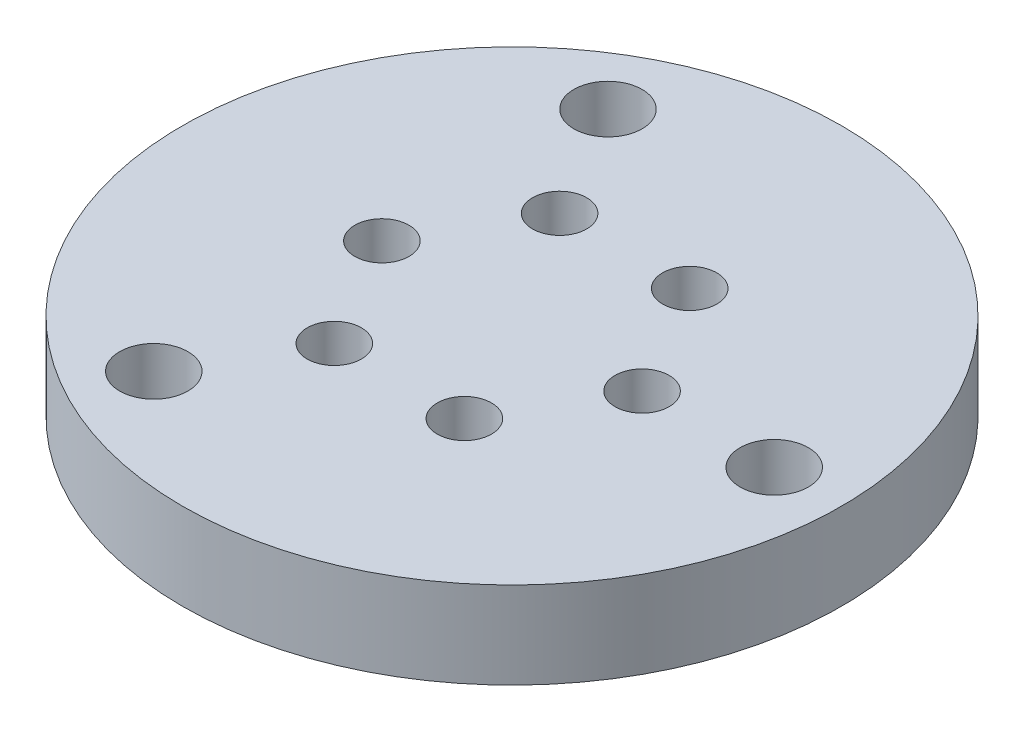
ISO-10303-21;
HEADER;
FILE_DESCRIPTION(('STEP AP214'),'2;1');
FILE_NAME('part.step','',(''),(''),'','','');
FILE_SCHEMA(('AUTOMOTIVE_DESIGN { 1 0 10303 214 1 1 1 1 }'));
ENDSEC;
DATA;
#1=APPLICATION_CONTEXT('core data for automotive mechanical design processes');
#2=APPLICATION_PROTOCOL_DEFINITION('international standard','automotive_design',2000,#1);
#3=PRODUCT_CONTEXT('',#1,'mechanical');
#4=PRODUCT('Part','Part','',(#3));
#5=PRODUCT_RELATED_PRODUCT_CATEGORY('part','',(#4));
#6=PRODUCT_DEFINITION_FORMATION('','',#4);
#7=PRODUCT_DEFINITION_CONTEXT('part definition',#1,'design');
#8=PRODUCT_DEFINITION('design','',#6,#7);
#9=PRODUCT_DEFINITION_SHAPE('','',#8);
#10=(LENGTH_UNIT() NAMED_UNIT(*) SI_UNIT(.MILLI.,.METRE.));
#11=(NAMED_UNIT(*) PLANE_ANGLE_UNIT() SI_UNIT($,.RADIAN.));
#12=(NAMED_UNIT(*) SI_UNIT($,.STERADIAN.) SOLID_ANGLE_UNIT());
#13=UNCERTAINTY_MEASURE_WITH_UNIT(LENGTH_MEASURE(1.E-05),#10,'distance_accuracy_value','');
#14=(GEOMETRIC_REPRESENTATION_CONTEXT(3) GLOBAL_UNCERTAINTY_ASSIGNED_CONTEXT((#13)) GLOBAL_UNIT_ASSIGNED_CONTEXT((#10,
#11,#12)) REPRESENTATION_CONTEXT('',''));
#15=CARTESIAN_POINT('',(0.,0.,0.));
#16=DIRECTION('',(0.,0.,1.));
#17=DIRECTION('',(1.,0.,0.));
#18=AXIS2_PLACEMENT_3D('',#15,#16,#17);
#19=CARTESIAN_POINT('',(0.,6.35,0.));
#20=DIRECTION('',(0.,1.,0.));
#21=DIRECTION('',(0.,0.,1.));
#22=AXIS2_PLACEMENT_3D('',#19,#20,#21);
#23=PLANE('',#22);
#24=CARTESIAN_POINT('',(4.76249999999999,6.35,-8.24889197104679));
#25=DIRECTION('',(0.,1.,0.));
#26=DIRECTION('',(0.,0.,1.));
#27=AXIS2_PLACEMENT_3D('',#24,#25,#26);
#28=CIRCLE('',#27,1.98437499999999);
#29=CARTESIAN_POINT('',(4.76249999999999,6.35,-6.2645169710468));
#30=VERTEX_POINT('',#29);
#31=EDGE_CURVE('E94',#30,#30,#28,.T.);
#32=ORIENTED_EDGE('',*,*,#31,.F.);
#33=EDGE_LOOP('',(#32));
#34=FACE_BOUND('',#33,.T.);
#35=CARTESIAN_POINT('',(-4.7625,6.35,-8.24889197104679));
#36=DIRECTION('',(0.,1.,0.));
#37=DIRECTION('',(0.,0.,1.));
#38=AXIS2_PLACEMENT_3D('',#35,#36,#37);
#39=CIRCLE('',#38,1.98437499999999);
#40=CARTESIAN_POINT('',(-4.7625,6.35,-6.2645169710468));
#41=VERTEX_POINT('',#40);
#42=EDGE_CURVE('E88',#41,#41,#39,.T.);
#43=ORIENTED_EDGE('',*,*,#42,.F.);
#44=EDGE_LOOP('',(#43));
#45=FACE_BOUND('',#44,.T.);
#46=CARTESIAN_POINT('',(-9.52500000000001,6.35,0.));
#47=DIRECTION('',(0.,1.,0.));
#48=DIRECTION('',(0.,0.,1.));
#49=AXIS2_PLACEMENT_3D('',#46,#47,#48);
#50=CIRCLE('',#49,1.98437499999999);
#51=CARTESIAN_POINT('',(-9.52500000000001,6.35,1.98437499999999));
#52=VERTEX_POINT('',#51);
#53=EDGE_CURVE('E82',#52,#52,#50,.T.);
#54=ORIENTED_EDGE('',*,*,#53,.F.);
#55=EDGE_LOOP('',(#54));
#56=FACE_BOUND('',#55,.T.);
#57=CARTESIAN_POINT('',(-4.7625,6.35,8.24889197104678));
#58=DIRECTION('',(0.,1.,0.));
#59=DIRECTION('',(0.,0.,1.));
#60=AXIS2_PLACEMENT_3D('',#57,#58,#59);
#61=CIRCLE('',#60,1.98437499999999);
#62=CARTESIAN_POINT('',(-4.7625,6.35,10.2332669710468));
#63=VERTEX_POINT('',#62);
#64=EDGE_CURVE('E76',#63,#63,#61,.T.);
#65=ORIENTED_EDGE('',*,*,#64,.F.);
#66=EDGE_LOOP('',(#65));
#67=FACE_BOUND('',#66,.T.);
#68=CARTESIAN_POINT('',(4.7625,6.35,8.24889197104679));
#69=DIRECTION('',(0.,1.,0.));
#70=DIRECTION('',(0.,0.,1.));
#71=AXIS2_PLACEMENT_3D('',#68,#69,#70);
#72=CIRCLE('',#71,1.98437499999999);
#73=CARTESIAN_POINT('',(4.7625,6.35,10.2332669710468));
#74=VERTEX_POINT('',#73);
#75=EDGE_CURVE('E70',#74,#74,#72,.T.);
#76=ORIENTED_EDGE('',*,*,#75,.F.);
#77=EDGE_LOOP('',(#76));
#78=FACE_BOUND('',#77,.T.);
#79=CARTESIAN_POINT('',(9.525,6.35,0.));
#80=DIRECTION('',(0.,1.,0.));
#81=DIRECTION('',(0.,0.,1.));
#82=AXIS2_PLACEMENT_3D('',#79,#80,#81);
#83=CIRCLE('',#82,1.98437499999999);
#84=CARTESIAN_POINT('',(9.525,6.35,1.98437499999999));
#85=VERTEX_POINT('',#84);
#86=EDGE_CURVE('E64',#85,#85,#83,.T.);
#87=ORIENTED_EDGE('',*,*,#86,.F.);
#88=EDGE_LOOP('',(#87));
#89=FACE_BOUND('',#88,.T.);
#90=CARTESIAN_POINT('',(-9.60000000000008,6.35,-16.6276877526612));
#91=DIRECTION('',(0.,1.,0.));
#92=DIRECTION('',(0.,0.,1.));
#93=AXIS2_PLACEMENT_3D('',#90,#91,#92);
#94=CIRCLE('',#93,2.5);
#95=CARTESIAN_POINT('',(-9.60000000000008,6.35,-14.1276877526612));
#96=VERTEX_POINT('',#95);
#97=EDGE_CURVE('E47',#96,#96,#94,.T.);
#98=ORIENTED_EDGE('',*,*,#97,.F.);
#99=EDGE_LOOP('',(#98));
#100=FACE_BOUND('',#99,.T.);
#101=CARTESIAN_POINT('',(0.,6.35,0.));
#102=DIRECTION('',(0.,1.,0.));
#103=DIRECTION('',(0.,0.,1.));
#104=AXIS2_PLACEMENT_3D('',#101,#102,#103);
#105=CIRCLE('',#104,24.13);
#106=CARTESIAN_POINT('',(0.,6.35,24.13));
#107=VERTEX_POINT('',#106);
#108=EDGE_CURVE('E10',#107,#107,#105,.T.);
#109=ORIENTED_EDGE('',*,*,#108,.T.);
#110=EDGE_LOOP('',(#109));
#111=FACE_BOUND('',#110,.T.);
#112=CARTESIAN_POINT('',(19.2,6.35,0.));
#113=DIRECTION('',(0.,1.,0.));
#114=DIRECTION('',(0.,0.,1.));
#115=AXIS2_PLACEMENT_3D('',#112,#113,#114);
#116=CIRCLE('',#115,2.5);
#117=CARTESIAN_POINT('',(19.2,6.35,2.5));
#118=VERTEX_POINT('',#117);
#119=EDGE_CURVE('E42',#118,#118,#116,.T.);
#120=ORIENTED_EDGE('',*,*,#119,.F.);
#121=EDGE_LOOP('',(#120));
#122=FACE_BOUND('',#121,.T.);
#123=CARTESIAN_POINT('',(-9.59999999999985,6.35,16.6276877526613));
#124=DIRECTION('',(0.,1.,0.));
#125=DIRECTION('',(0.,0.,1.));
#126=AXIS2_PLACEMENT_3D('',#123,#124,#125);
#127=CIRCLE('',#126,2.5);
#128=CARTESIAN_POINT('',(-9.59999999999985,6.35,19.1276877526613));
#129=VERTEX_POINT('',#128);
#130=EDGE_CURVE('E53',#129,#129,#127,.T.);
#131=ORIENTED_EDGE('',*,*,#130,.F.);
#132=EDGE_LOOP('',(#131));
#133=FACE_BOUND('',#132,.T.);
#134=ADVANCED_FACE('F31',(#34,#45,#56,#67,#78,#89,#100,#111,#122,#133),#23,.T.);
#135=CARTESIAN_POINT('',(0.,0.,0.));
#136=DIRECTION('',(0.,1.,0.));
#137=DIRECTION('',(0.,0.,1.));
#138=AXIS2_PLACEMENT_3D('',#135,#136,#137);
#139=PLANE('',#138);
#140=CARTESIAN_POINT('',(4.76249999999999,0.,-8.24889197104679));
#141=DIRECTION('',(0.,1.,0.));
#142=DIRECTION('',(0.,0.,1.));
#143=AXIS2_PLACEMENT_3D('',#140,#141,#142);
#144=CIRCLE('',#143,1.984375);
#145=CARTESIAN_POINT('',(4.76249999999999,0.,-6.26451697104679));
#146=VERTEX_POINT('',#145);
#147=EDGE_CURVE('E91',#146,#146,#144,.T.);
#148=ORIENTED_EDGE('',*,*,#147,.T.);
#149=EDGE_LOOP('',(#148));
#150=FACE_BOUND('',#149,.T.);
#151=CARTESIAN_POINT('',(-4.7625,0.,-8.24889197104679));
#152=DIRECTION('',(0.,1.,0.));
#153=DIRECTION('',(0.,0.,1.));
#154=AXIS2_PLACEMENT_3D('',#151,#152,#153);
#155=CIRCLE('',#154,1.984375);
#156=CARTESIAN_POINT('',(-4.7625,0.,-6.26451697104679));
#157=VERTEX_POINT('',#156);
#158=EDGE_CURVE('E85',#157,#157,#155,.T.);
#159=ORIENTED_EDGE('',*,*,#158,.T.);
#160=EDGE_LOOP('',(#159));
#161=FACE_BOUND('',#160,.T.);
#162=CARTESIAN_POINT('',(-9.52500000000001,0.,0.));
#163=DIRECTION('',(0.,1.,0.));
#164=DIRECTION('',(0.,0.,1.));
#165=AXIS2_PLACEMENT_3D('',#162,#163,#164);
#166=CIRCLE('',#165,1.984375);
#167=CARTESIAN_POINT('',(-9.52500000000001,0.,1.984375));
#168=VERTEX_POINT('',#167);
#169=EDGE_CURVE('E79',#168,#168,#166,.T.);
#170=ORIENTED_EDGE('',*,*,#169,.T.);
#171=EDGE_LOOP('',(#170));
#172=FACE_BOUND('',#171,.T.);
#173=CARTESIAN_POINT('',(-4.7625,0.,8.24889197104678));
#174=DIRECTION('',(0.,1.,0.));
#175=DIRECTION('',(0.,0.,1.));
#176=AXIS2_PLACEMENT_3D('',#173,#174,#175);
#177=CIRCLE('',#176,1.984375);
#178=CARTESIAN_POINT('',(-4.7625,0.,10.2332669710468));
#179=VERTEX_POINT('',#178);
#180=EDGE_CURVE('E73',#179,#179,#177,.T.);
#181=ORIENTED_EDGE('',*,*,#180,.T.);
#182=EDGE_LOOP('',(#181));
#183=FACE_BOUND('',#182,.T.);
#184=CARTESIAN_POINT('',(4.7625,0.,8.24889197104679));
#185=DIRECTION('',(0.,1.,0.));
#186=DIRECTION('',(0.,0.,1.));
#187=AXIS2_PLACEMENT_3D('',#184,#185,#186);
#188=CIRCLE('',#187,1.984375);
#189=CARTESIAN_POINT('',(4.7625,0.,10.2332669710468));
#190=VERTEX_POINT('',#189);
#191=EDGE_CURVE('E67',#190,#190,#188,.T.);
#192=ORIENTED_EDGE('',*,*,#191,.T.);
#193=EDGE_LOOP('',(#192));
#194=FACE_BOUND('',#193,.T.);
#195=CARTESIAN_POINT('',(9.525,0.,0.));
#196=DIRECTION('',(0.,1.,0.));
#197=DIRECTION('',(0.,0.,1.));
#198=AXIS2_PLACEMENT_3D('',#195,#196,#197);
#199=CIRCLE('',#198,1.984375);
#200=CARTESIAN_POINT('',(9.525,0.,1.984375));
#201=VERTEX_POINT('',#200);
#202=EDGE_CURVE('E59',#201,#201,#199,.T.);
#203=ORIENTED_EDGE('',*,*,#202,.T.);
#204=EDGE_LOOP('',(#203));
#205=FACE_BOUND('',#204,.T.);
#206=CARTESIAN_POINT('',(0.,0.,0.));
#207=DIRECTION('',(0.,1.,0.));
#208=DIRECTION('',(0.,0.,1.));
#209=AXIS2_PLACEMENT_3D('',#206,#207,#208);
#210=CIRCLE('',#209,24.13);
#211=CARTESIAN_POINT('',(0.,0.,24.13));
#212=VERTEX_POINT('',#211);
#213=EDGE_CURVE('E35',#212,#212,#210,.T.);
#214=ORIENTED_EDGE('',*,*,#213,.F.);
#215=EDGE_LOOP('',(#214));
#216=FACE_BOUND('',#215,.T.);
#217=CARTESIAN_POINT('',(19.2,0.,0.));
#218=DIRECTION('',(0.,1.,0.));
#219=DIRECTION('',(0.,0.,1.));
#220=AXIS2_PLACEMENT_3D('',#217,#218,#219);
#221=CIRCLE('',#220,2.5);
#222=CARTESIAN_POINT('',(19.2,0.,2.5));
#223=VERTEX_POINT('',#222);
#224=EDGE_CURVE('E44',#223,#223,#221,.T.);
#225=ORIENTED_EDGE('',*,*,#224,.T.);
#226=EDGE_LOOP('',(#225));
#227=FACE_BOUND('',#226,.T.);
#228=CARTESIAN_POINT('',(-9.60000000000008,0.,-16.6276877526612));
#229=DIRECTION('',(0.,1.,0.));
#230=DIRECTION('',(0.,0.,1.));
#231=AXIS2_PLACEMENT_3D('',#228,#229,#230);
#232=CIRCLE('',#231,2.5);
#233=CARTESIAN_POINT('',(-9.60000000000008,0.,-14.1276877526612));
#234=VERTEX_POINT('',#233);
#235=EDGE_CURVE('E50',#234,#234,#232,.T.);
#236=ORIENTED_EDGE('',*,*,#235,.T.);
#237=EDGE_LOOP('',(#236));
#238=FACE_BOUND('',#237,.T.);
#239=CARTESIAN_POINT('',(-9.59999999999985,0.,16.6276877526613));
#240=DIRECTION('',(0.,1.,0.));
#241=DIRECTION('',(0.,0.,1.));
#242=AXIS2_PLACEMENT_3D('',#239,#240,#241);
#243=CIRCLE('',#242,2.5);
#244=CARTESIAN_POINT('',(-9.59999999999985,0.,19.1276877526613));
#245=VERTEX_POINT('',#244);
#246=EDGE_CURVE('E56',#245,#245,#243,.T.);
#247=ORIENTED_EDGE('',*,*,#246,.T.);
#248=EDGE_LOOP('',(#247));
#249=FACE_BOUND('',#248,.T.);
#250=ADVANCED_FACE('F102',(#150,#161,#172,#183,#194,#205,#216,#227,#238,#249),#139,.F.);
#251=CARTESIAN_POINT('',(0.,6.35,0.));
#252=DIRECTION('',(0.,-1.,0.));
#253=DIRECTION('',(0.,0.,-1.));
#254=AXIS2_PLACEMENT_3D('',#251,#252,#253);
#255=CYLINDRICAL_SURFACE('',#254,24.13);
#256=ORIENTED_EDGE('',*,*,#108,.F.);
#257=EDGE_LOOP('',(#256));
#258=FACE_BOUND('',#257,.T.);
#259=ORIENTED_EDGE('',*,*,#213,.T.);
#260=EDGE_LOOP('',(#259));
#261=FACE_BOUND('',#260,.T.);
#262=ADVANCED_FACE('F33',(#258,#261),#255,.T.);
#263=CARTESIAN_POINT('',(19.2,6.35,0.));
#264=DIRECTION('',(0.,-1.,0.));
#265=DIRECTION('',(0.,0.,-1.));
#266=AXIS2_PLACEMENT_3D('',#263,#264,#265);
#267=CYLINDRICAL_SURFACE('',#266,2.5);
#268=ORIENTED_EDGE('',*,*,#119,.T.);
#269=EDGE_LOOP('',(#268));
#270=FACE_BOUND('',#269,.T.);
#271=ORIENTED_EDGE('',*,*,#224,.F.);
#272=EDGE_LOOP('',(#271));
#273=FACE_BOUND('',#272,.T.);
#274=ADVANCED_FACE('F133',(#270,#273),#267,.F.);
#275=CARTESIAN_POINT('',(-9.60000000000008,6.35,-16.6276877526612));
#276=DIRECTION('',(0.,-1.,0.));
#277=DIRECTION('',(0.,0.,-1.));
#278=AXIS2_PLACEMENT_3D('',#275,#276,#277);
#279=CYLINDRICAL_SURFACE('',#278,2.5);
#280=ORIENTED_EDGE('',*,*,#97,.T.);
#281=EDGE_LOOP('',(#280));
#282=FACE_BOUND('',#281,.T.);
#283=ORIENTED_EDGE('',*,*,#235,.F.);
#284=EDGE_LOOP('',(#283));
#285=FACE_BOUND('',#284,.T.);
#286=ADVANCED_FACE('F124',(#282,#285),#279,.F.);
#287=CARTESIAN_POINT('',(-9.59999999999985,6.35,16.6276877526613));
#288=DIRECTION('',(0.,-1.,0.));
#289=DIRECTION('',(0.,0.,-1.));
#290=AXIS2_PLACEMENT_3D('',#287,#288,#289);
#291=CYLINDRICAL_SURFACE('',#290,2.5);
#292=ORIENTED_EDGE('',*,*,#130,.T.);
#293=EDGE_LOOP('',(#292));
#294=FACE_BOUND('',#293,.T.);
#295=ORIENTED_EDGE('',*,*,#246,.F.);
#296=EDGE_LOOP('',(#295));
#297=FACE_BOUND('',#296,.T.);
#298=ADVANCED_FACE('F120',(#294,#297),#291,.F.);
#299=CARTESIAN_POINT('',(9.525,6.35,0.));
#300=DIRECTION('',(0.,1.,0.));
#301=DIRECTION('',(0.,0.,1.));
#302=AXIS2_PLACEMENT_3D('',#299,#300,#301);
#303=CYLINDRICAL_SURFACE('',#302,1.98437499999999);
#304=ORIENTED_EDGE('',*,*,#202,.F.);
#305=EDGE_LOOP('',(#304));
#306=FACE_BOUND('',#305,.T.);
#307=ORIENTED_EDGE('',*,*,#86,.T.);
#308=EDGE_LOOP('',(#307));
#309=FACE_BOUND('',#308,.T.);
#310=ADVANCED_FACE('F123',(#306,#309),#303,.F.);
#311=CARTESIAN_POINT('',(4.7625,6.35,8.24889197104679));
#312=DIRECTION('',(0.,1.,0.));
#313=DIRECTION('',(0.,0.,1.));
#314=AXIS2_PLACEMENT_3D('',#311,#312,#313);
#315=CYLINDRICAL_SURFACE('',#314,1.98437499999999);
#316=ORIENTED_EDGE('',*,*,#191,.F.);
#317=EDGE_LOOP('',(#316));
#318=FACE_BOUND('',#317,.T.);
#319=ORIENTED_EDGE('',*,*,#75,.T.);
#320=EDGE_LOOP('',(#319));
#321=FACE_BOUND('',#320,.T.);
#322=ADVANCED_FACE('F145',(#318,#321),#315,.F.);
#323=CARTESIAN_POINT('',(-4.7625,6.35,8.24889197104678));
#324=DIRECTION('',(0.,1.,0.));
#325=DIRECTION('',(0.,0.,1.));
#326=AXIS2_PLACEMENT_3D('',#323,#324,#325);
#327=CYLINDRICAL_SURFACE('',#326,1.98437499999999);
#328=ORIENTED_EDGE('',*,*,#180,.F.);
#329=EDGE_LOOP('',(#328));
#330=FACE_BOUND('',#329,.T.);
#331=ORIENTED_EDGE('',*,*,#64,.T.);
#332=EDGE_LOOP('',(#331));
#333=FACE_BOUND('',#332,.T.);
#334=ADVANCED_FACE('F149',(#330,#333),#327,.F.);
#335=CARTESIAN_POINT('',(-9.52500000000001,6.35,0.));
#336=DIRECTION('',(0.,1.,0.));
#337=DIRECTION('',(0.,0.,1.));
#338=AXIS2_PLACEMENT_3D('',#335,#336,#337);
#339=CYLINDRICAL_SURFACE('',#338,1.98437499999999);
#340=ORIENTED_EDGE('',*,*,#169,.F.);
#341=EDGE_LOOP('',(#340));
#342=FACE_BOUND('',#341,.T.);
#343=ORIENTED_EDGE('',*,*,#53,.T.);
#344=EDGE_LOOP('',(#343));
#345=FACE_BOUND('',#344,.T.);
#346=ADVANCED_FACE('F153',(#342,#345),#339,.F.);
#347=CARTESIAN_POINT('',(-4.7625,6.35,-8.24889197104679));
#348=DIRECTION('',(0.,1.,0.));
#349=DIRECTION('',(0.,0.,1.));
#350=AXIS2_PLACEMENT_3D('',#347,#348,#349);
#351=CYLINDRICAL_SURFACE('',#350,1.98437499999999);
#352=ORIENTED_EDGE('',*,*,#158,.F.);
#353=EDGE_LOOP('',(#352));
#354=FACE_BOUND('',#353,.T.);
#355=ORIENTED_EDGE('',*,*,#42,.T.);
#356=EDGE_LOOP('',(#355));
#357=FACE_BOUND('',#356,.T.);
#358=ADVANCED_FACE('F157',(#354,#357),#351,.F.);
#359=CARTESIAN_POINT('',(4.76249999999999,6.35,-8.24889197104679));
#360=DIRECTION('',(0.,1.,0.));
#361=DIRECTION('',(0.,0.,1.));
#362=AXIS2_PLACEMENT_3D('',#359,#360,#361);
#363=CYLINDRICAL_SURFACE('',#362,1.98437499999999);
#364=ORIENTED_EDGE('',*,*,#147,.F.);
#365=EDGE_LOOP('',(#364));
#366=FACE_BOUND('',#365,.T.);
#367=ORIENTED_EDGE('',*,*,#31,.T.);
#368=EDGE_LOOP('',(#367));
#369=FACE_BOUND('',#368,.T.);
#370=ADVANCED_FACE('F98',(#366,#369),#363,.F.);
#371=CLOSED_SHELL('',(#134,#250,#262,#274,#286,#298,#310,#322,#334,#346,#358,#370));
#372=MANIFOLD_SOLID_BREP('B2',#371);
#373=ADVANCED_BREP_SHAPE_REPRESENTATION('',(#18,#372),#14);
#374=SHAPE_DEFINITION_REPRESENTATION(#9,#373);
ENDSEC;
END-ISO-10303-21;
